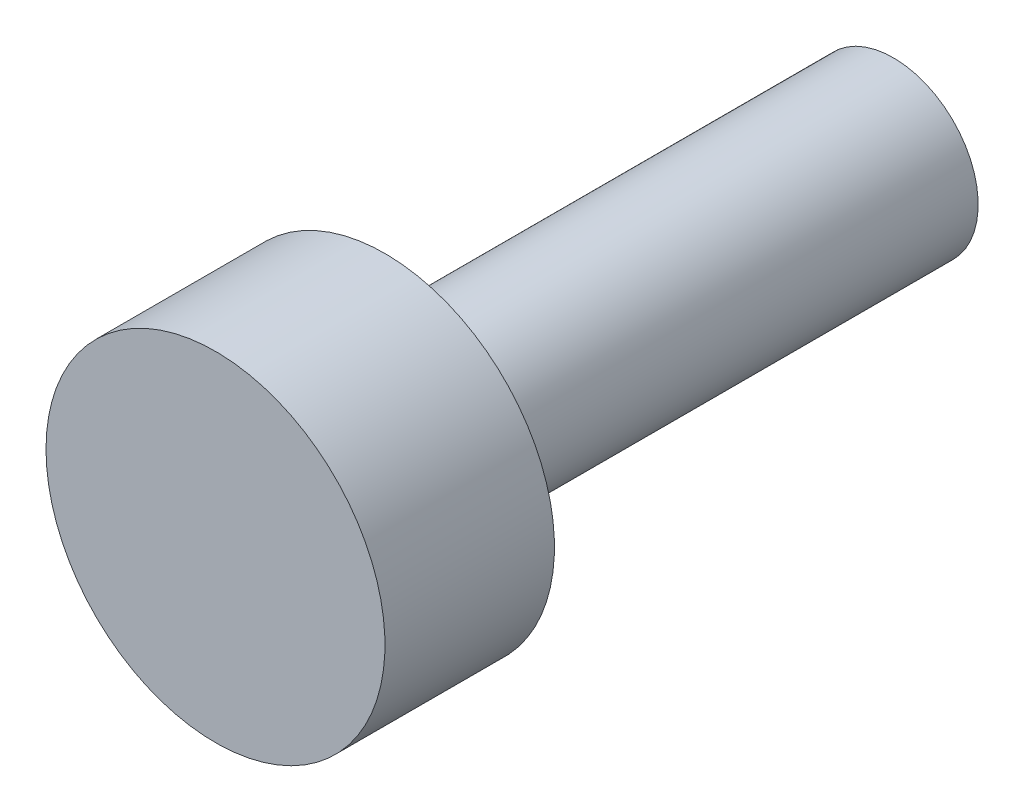
ISO-10303-21;
HEADER;
FILE_DESCRIPTION(('STEP AP214'),'2;1');
FILE_NAME('part.step','',(''),(''),'','','');
FILE_SCHEMA(('AUTOMOTIVE_DESIGN { 1 0 10303 214 1 1 1 1 }'));
ENDSEC;
DATA;
#1=APPLICATION_CONTEXT('core data for automotive mechanical design processes');
#2=APPLICATION_PROTOCOL_DEFINITION('international standard','automotive_design',2000,#1);
#3=PRODUCT_CONTEXT('',#1,'mechanical');
#4=PRODUCT('Part','Part','',(#3));
#5=PRODUCT_RELATED_PRODUCT_CATEGORY('part','',(#4));
#6=PRODUCT_DEFINITION_FORMATION('','',#4);
#7=PRODUCT_DEFINITION_CONTEXT('part definition',#1,'design');
#8=PRODUCT_DEFINITION('design','',#6,#7);
#9=PRODUCT_DEFINITION_SHAPE('','',#8);
#10=(LENGTH_UNIT() NAMED_UNIT(*) SI_UNIT(.MILLI.,.METRE.));
#11=(NAMED_UNIT(*) PLANE_ANGLE_UNIT() SI_UNIT($,.RADIAN.));
#12=(NAMED_UNIT(*) SI_UNIT($,.STERADIAN.) SOLID_ANGLE_UNIT());
#13=UNCERTAINTY_MEASURE_WITH_UNIT(LENGTH_MEASURE(1.E-05),#10,'distance_accuracy_value','');
#14=(GEOMETRIC_REPRESENTATION_CONTEXT(3) GLOBAL_UNCERTAINTY_ASSIGNED_CONTEXT((#13)) GLOBAL_UNIT_ASSIGNED_CONTEXT((#10,
#11,#12)) REPRESENTATION_CONTEXT('',''));
#15=CARTESIAN_POINT('',(0.,0.,0.));
#16=DIRECTION('',(0.,0.,1.));
#17=DIRECTION('',(1.,0.,0.));
#18=AXIS2_PLACEMENT_3D('',#15,#16,#17);
#19=CARTESIAN_POINT('',(-2.50000000000001,0.,-8.53260869565217));
#20=DIRECTION('',(0.,0.,-1.));
#21=DIRECTION('',(-1.,0.,0.));
#22=AXIS2_PLACEMENT_3D('',#19,#20,#21);
#23=PLANE('',#22);
#24=CARTESIAN_POINT('',(0.,0.,-8.53260869565217));
#25=DIRECTION('',(0.,0.,-1.));
#26=DIRECTION('',(-1.,0.,0.));
#27=AXIS2_PLACEMENT_3D('',#24,#25,#26);
#28=CIRCLE('',#27,2.50000000000001);
#29=CARTESIAN_POINT('',(-2.50000000000001,0.,-8.53260869565217));
#30=VERTEX_POINT('',#29);
#31=EDGE_CURVE('E58',#30,#30,#28,.T.);
#32=ORIENTED_EDGE('',*,*,#31,.T.);
#33=EDGE_LOOP('',(#32));
#34=FACE_BOUND('',#33,.T.);
#35=ADVANCED_FACE('F41',(#34),#23,.T.);
#36=CARTESIAN_POINT('',(0.,0.,11.4673913043478));
#37=DIRECTION('',(0.,0.,1.));
#38=DIRECTION('',(1.,0.,0.));
#39=AXIS2_PLACEMENT_3D('',#36,#37,#38);
#40=PLANE('',#39);
#41=CARTESIAN_POINT('',(0.,0.,11.4673913043478));
#42=DIRECTION('',(0.,0.,-1.));
#43=DIRECTION('',(-1.,0.,0.));
#44=AXIS2_PLACEMENT_3D('',#41,#42,#43);
#45=CIRCLE('',#44,5.);
#46=CARTESIAN_POINT('',(-5.,0.,11.4673913043478));
#47=VERTEX_POINT('',#46);
#48=EDGE_CURVE('E10',#47,#47,#45,.T.);
#49=ORIENTED_EDGE('',*,*,#48,.F.);
#50=EDGE_LOOP('',(#49));
#51=FACE_BOUND('',#50,.T.);
#52=ADVANCED_FACE('F77',(#51),#40,.T.);
#53=CARTESIAN_POINT('',(0.,0.,-8.53260869565217));
#54=DIRECTION('',(0.,0.,-1.));
#55=DIRECTION('',(-1.,0.,0.));
#56=AXIS2_PLACEMENT_3D('',#53,#54,#55);
#57=CYLINDRICAL_SURFACE('',#56,5.);
#58=ORIENTED_EDGE('',*,*,#48,.T.);
#59=EDGE_LOOP('',(#58));
#60=FACE_BOUND('',#59,.T.);
#61=CARTESIAN_POINT('',(0.,0.,6.46739130434783));
#62=DIRECTION('',(0.,0.,-1.));
#63=DIRECTION('',(-1.,0.,0.));
#64=AXIS2_PLACEMENT_3D('',#61,#62,#63);
#65=CIRCLE('',#64,5.);
#66=CARTESIAN_POINT('',(-5.,0.,6.46739130434783));
#67=VERTEX_POINT('',#66);
#68=EDGE_CURVE('E48',#67,#67,#65,.T.);
#69=ORIENTED_EDGE('',*,*,#68,.F.);
#70=EDGE_LOOP('',(#69));
#71=FACE_BOUND('',#70,.T.);
#72=ADVANCED_FACE('F74',(#60,#71),#57,.T.);
#73=CARTESIAN_POINT('',(-5.,0.,6.46739130434783));
#74=DIRECTION('',(0.,0.,-1.));
#75=DIRECTION('',(-1.,0.,0.));
#76=AXIS2_PLACEMENT_3D('',#73,#74,#75);
#77=PLANE('',#76);
#78=ORIENTED_EDGE('',*,*,#68,.T.);
#79=EDGE_LOOP('',(#78));
#80=FACE_BOUND('',#79,.T.);
#81=CARTESIAN_POINT('',(0.,0.,6.46739130434783));
#82=DIRECTION('',(0.,0.,-1.));
#83=DIRECTION('',(-1.,0.,0.));
#84=AXIS2_PLACEMENT_3D('',#81,#82,#83);
#85=CIRCLE('',#84,2.5);
#86=CARTESIAN_POINT('',(-2.5,0.,6.46739130434783));
#87=VERTEX_POINT('',#86);
#88=EDGE_CURVE('E53',#87,#87,#85,.T.);
#89=ORIENTED_EDGE('',*,*,#88,.F.);
#90=EDGE_LOOP('',(#89));
#91=FACE_BOUND('',#90,.T.);
#92=ADVANCED_FACE('F68',(#80,#91),#77,.T.);
#93=CARTESIAN_POINT('',(0.,0.,-8.53260869565217));
#94=DIRECTION('',(0.,0.,-1.));
#95=DIRECTION('',(-1.,0.,0.));
#96=AXIS2_PLACEMENT_3D('',#93,#94,#95);
#97=CYLINDRICAL_SURFACE('',#96,2.50000000000001);
#98=ORIENTED_EDGE('',*,*,#88,.T.);
#99=EDGE_LOOP('',(#98));
#100=FACE_BOUND('',#99,.T.);
#101=ORIENTED_EDGE('',*,*,#31,.F.);
#102=EDGE_LOOP('',(#101));
#103=FACE_BOUND('',#102,.T.);
#104=ADVANCED_FACE('F66',(#100,#103),#97,.T.);
#105=CLOSED_SHELL('',(#35,#52,#72,#92,#104));
#106=MANIFOLD_SOLID_BREP('B2',#105);
#107=ADVANCED_BREP_SHAPE_REPRESENTATION('',(#18,#106),#14);
#108=SHAPE_DEFINITION_REPRESENTATION(#9,#107);
ENDSEC;
END-ISO-10303-21;
